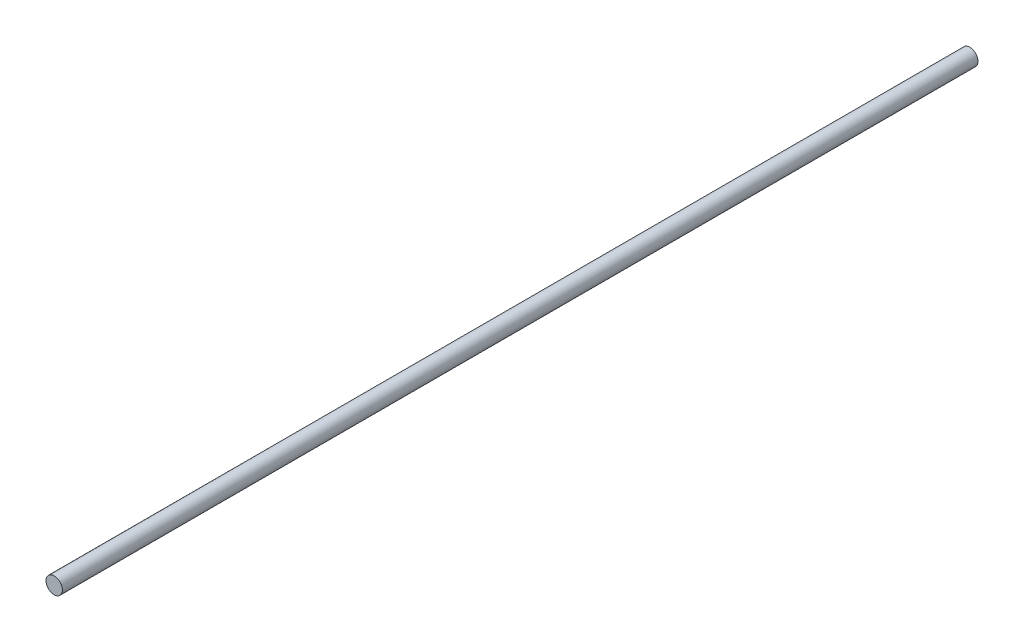
ISO-10303-21;
HEADER;
FILE_DESCRIPTION(('STEP AP214'),'2;1');
FILE_NAME('part.step','',(''),(''),'','','');
FILE_SCHEMA(('AUTOMOTIVE_DESIGN { 1 0 10303 214 1 1 1 1 }'));
ENDSEC;
DATA;
#1=APPLICATION_CONTEXT('core data for automotive mechanical design processes');
#2=APPLICATION_PROTOCOL_DEFINITION('international standard','automotive_design',2000,#1);
#3=PRODUCT_CONTEXT('',#1,'mechanical');
#4=PRODUCT('Part','Part','',(#3));
#5=PRODUCT_RELATED_PRODUCT_CATEGORY('part','',(#4));
#6=PRODUCT_DEFINITION_FORMATION('','',#4);
#7=PRODUCT_DEFINITION_CONTEXT('part definition',#1,'design');
#8=PRODUCT_DEFINITION('design','',#6,#7);
#9=PRODUCT_DEFINITION_SHAPE('','',#8);
#10=(LENGTH_UNIT() NAMED_UNIT(*) SI_UNIT(.MILLI.,.METRE.));
#11=(NAMED_UNIT(*) PLANE_ANGLE_UNIT() SI_UNIT($,.RADIAN.));
#12=(NAMED_UNIT(*) SI_UNIT($,.STERADIAN.) SOLID_ANGLE_UNIT());
#13=UNCERTAINTY_MEASURE_WITH_UNIT(LENGTH_MEASURE(1.E-05),#10,'distance_accuracy_value','');
#14=(GEOMETRIC_REPRESENTATION_CONTEXT(3) GLOBAL_UNCERTAINTY_ASSIGNED_CONTEXT((#13)) GLOBAL_UNIT_ASSIGNED_CONTEXT((#10,
#11,#12)) REPRESENTATION_CONTEXT('',''));
#15=CARTESIAN_POINT('',(0.,0.,0.));
#16=DIRECTION('',(0.,0.,1.));
#17=DIRECTION('',(1.,0.,0.));
#18=AXIS2_PLACEMENT_3D('',#15,#16,#17);
#19=CARTESIAN_POINT('',(0.,0.,448.));
#20=DIRECTION('',(0.,0.,-1.));
#21=DIRECTION('',(-1.,0.,0.));
#22=AXIS2_PLACEMENT_3D('',#19,#20,#21);
#23=CYLINDRICAL_SURFACE('',#22,4.);
#24=CARTESIAN_POINT('',(0.,0.,448.));
#25=DIRECTION('',(0.,0.,1.));
#26=DIRECTION('',(1.,0.,0.));
#27=AXIS2_PLACEMENT_3D('',#24,#25,#26);
#28=CIRCLE('',#27,4.);
#29=CARTESIAN_POINT('',(4.,0.,448.));
#30=VERTEX_POINT('',#29);
#31=EDGE_CURVE('E10',#30,#30,#28,.T.);
#32=ORIENTED_EDGE('',*,*,#31,.F.);
#33=EDGE_LOOP('',(#32));
#34=FACE_BOUND('',#33,.T.);
#35=CARTESIAN_POINT('',(0.,0.,0.));
#36=DIRECTION('',(0.,0.,1.));
#37=DIRECTION('',(1.,0.,0.));
#38=AXIS2_PLACEMENT_3D('',#35,#36,#37);
#39=CIRCLE('',#38,4.);
#40=CARTESIAN_POINT('',(4.,0.,0.));
#41=VERTEX_POINT('',#40);
#42=EDGE_CURVE('E34',#41,#41,#39,.T.);
#43=ORIENTED_EDGE('',*,*,#42,.T.);
#44=EDGE_LOOP('',(#43));
#45=FACE_BOUND('',#44,.T.);
#46=ADVANCED_FACE('F31',(#34,#45),#23,.T.);
#47=CARTESIAN_POINT('',(0.,0.,448.));
#48=DIRECTION('',(0.,0.,1.));
#49=DIRECTION('',(1.,0.,0.));
#50=AXIS2_PLACEMENT_3D('',#47,#48,#49);
#51=PLANE('',#50);
#52=ORIENTED_EDGE('',*,*,#31,.T.);
#53=EDGE_LOOP('',(#52));
#54=FACE_BOUND('',#53,.T.);
#55=ADVANCED_FACE('F46',(#54),#51,.T.);
#56=CARTESIAN_POINT('',(0.,0.,0.));
#57=DIRECTION('',(0.,0.,1.));
#58=DIRECTION('',(1.,0.,0.));
#59=AXIS2_PLACEMENT_3D('',#56,#57,#58);
#60=PLANE('',#59);
#61=ORIENTED_EDGE('',*,*,#42,.F.);
#62=EDGE_LOOP('',(#61));
#63=FACE_BOUND('',#62,.T.);
#64=ADVANCED_FACE('F44',(#63),#60,.F.);
#65=CLOSED_SHELL('',(#46,#55,#64));
#66=MANIFOLD_SOLID_BREP('B2',#65);
#67=ADVANCED_BREP_SHAPE_REPRESENTATION('',(#18,#66),#14);
#68=SHAPE_DEFINITION_REPRESENTATION(#9,#67);
ENDSEC;
END-ISO-10303-21;
